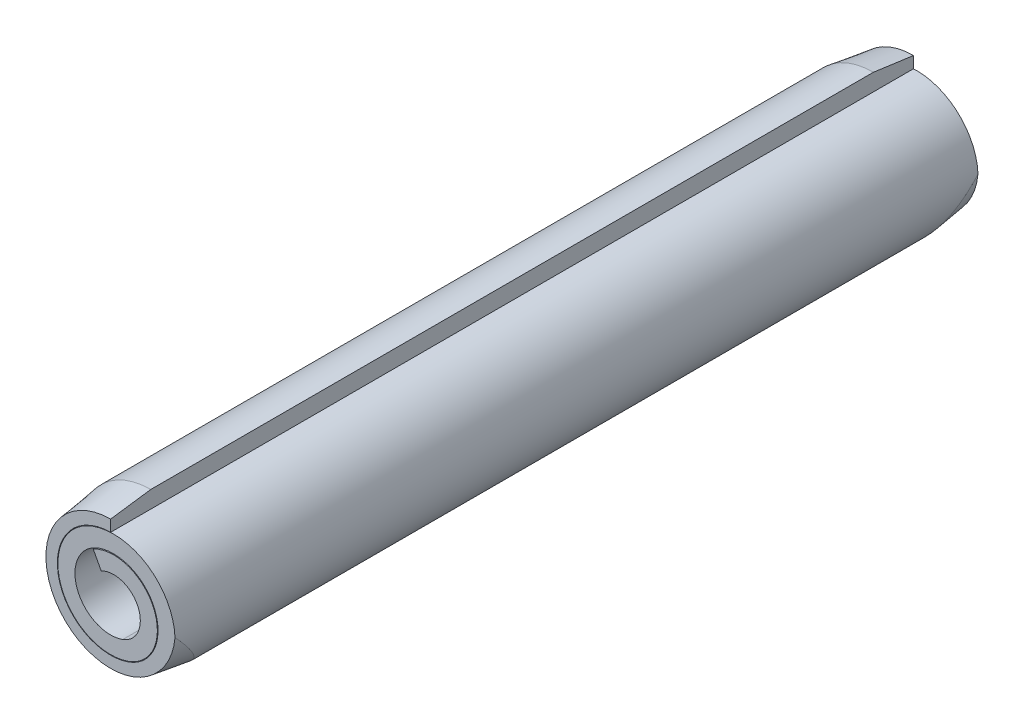
ISO-10303-21;
HEADER;
FILE_DESCRIPTION(('STEP AP214'),'2;1');
FILE_NAME('part.step','',(''),(''),'','','');
FILE_SCHEMA(('AUTOMOTIVE_DESIGN { 1 0 10303 214 1 1 1 1 }'));
ENDSEC;
DATA;
#1=APPLICATION_CONTEXT('core data for automotive mechanical design processes');
#2=APPLICATION_PROTOCOL_DEFINITION('international standard','automotive_design',2000,#1);
#3=PRODUCT_CONTEXT('',#1,'mechanical');
#4=PRODUCT('Part','Part','',(#3));
#5=PRODUCT_RELATED_PRODUCT_CATEGORY('part','',(#4));
#6=PRODUCT_DEFINITION_FORMATION('','',#4);
#7=PRODUCT_DEFINITION_CONTEXT('part definition',#1,'design');
#8=PRODUCT_DEFINITION('design','',#6,#7);
#9=PRODUCT_DEFINITION_SHAPE('','',#8);
#10=(LENGTH_UNIT() NAMED_UNIT(*) SI_UNIT(.MILLI.,.METRE.));
#11=(NAMED_UNIT(*) PLANE_ANGLE_UNIT() SI_UNIT($,.RADIAN.));
#12=(NAMED_UNIT(*) SI_UNIT($,.STERADIAN.) SOLID_ANGLE_UNIT());
#13=UNCERTAINTY_MEASURE_WITH_UNIT(LENGTH_MEASURE(1.E-05),#10,'distance_accuracy_value','');
#14=(GEOMETRIC_REPRESENTATION_CONTEXT(3) GLOBAL_UNCERTAINTY_ASSIGNED_CONTEXT((#13)) GLOBAL_UNIT_ASSIGNED_CONTEXT((#10,
#11,#12)) REPRESENTATION_CONTEXT('',''));
#15=CARTESIAN_POINT('',(0.,0.,0.));
#16=DIRECTION('',(0.,0.,1.));
#17=DIRECTION('',(1.,0.,0.));
#18=AXIS2_PLACEMENT_3D('',#15,#16,#17);
#19=CARTESIAN_POINT('',(-0.211085830625034,0.338291437783564,-9.));
#20=DIRECTION('',(0.883353817881994,0.468706765935062,0.));
#21=DIRECTION('',(-0.468706765935062,0.883353817881994,0.));
#22=AXIS2_PLACEMENT_3D('',#19,#20,#21);
#23=PLANE('',#22);
#24=DIRECTION('',(0.,0.,1.));
#25=VECTOR('',#24,1.);
#26=CARTESIAN_POINT('',(-0.390102521039357,0.675677386600868,-9.));
#27=LINE('',#26,#25);
#28=CARTESIAN_POINT('',(-0.390102521039357,0.675677386600868,-9.));
#29=VERTEX_POINT('',#28);
#30=CARTESIAN_POINT('',(-0.390102521039357,0.675677386600868,9.));
#31=VERTEX_POINT('',#30);
#32=EDGE_CURVE('E240',#29,#31,#27,.T.);
#33=ORIENTED_EDGE('',*,*,#32,.F.);
#34=DIRECTION('',(-0.468706765935062,0.883353817881994,0.));
#35=VECTOR('',#34,1.);
#36=CARTESIAN_POINT('',(-0.211085830625034,0.338291437783564,-9.));
#37=LINE('',#36,#35);
#38=CARTESIAN_POINT('',(-0.211085830625034,0.338291437783564,-9.));
#39=VERTEX_POINT('',#38);
#40=EDGE_CURVE('E125',#39,#29,#37,.T.);
#41=ORIENTED_EDGE('',*,*,#40,.F.);
#42=DIRECTION('',(0.,0.,1.));
#43=VECTOR('',#42,1.);
#44=CARTESIAN_POINT('',(-0.211085830625034,0.338291437783564,-9.));
#45=LINE('',#44,#43);
#46=CARTESIAN_POINT('',(-0.211085830625034,0.338291437783564,9.));
#47=VERTEX_POINT('',#46);
#48=EDGE_CURVE('E109',#47,#39,#45,.F.);
#49=ORIENTED_EDGE('',*,*,#48,.F.);
#50=DIRECTION('',(-0.468706765935062,0.883353817881994,0.));
#51=VECTOR('',#50,1.);
#52=CARTESIAN_POINT('',(-0.211085830625034,0.338291437783564,9.));
#53=LINE('',#52,#51);
#54=EDGE_CURVE('E116',#31,#47,#53,.F.);
#55=ORIENTED_EDGE('',*,*,#54,.F.);
#56=EDGE_LOOP('',(#33,#41,#49,#55));
#57=FACE_BOUND('',#56,.T.);
#58=ADVANCED_FACE('F16',(#57),#23,.F.);
#59=CARTESIAN_POINT('',(0.0689996919525346,-0.189575095588917,-9.));
#60=DIRECTION('',(0.,0.,1.));
#61=DIRECTION('',(1.,0.,0.));
#62=AXIS2_PLACEMENT_3D('',#59,#60,#61);
#63=CYLINDRICAL_SURFACE('',#62,0.597570897059278);
#64=CARTESIAN_POINT('',(0.0689996919525346,-0.189575095588917,-9.));
#65=DIRECTION('',(0.,0.,1.));
#66=DIRECTION('',(1.,0.,0.));
#67=AXIS2_PLACEMENT_3D('',#64,#65,#66);
#68=CIRCLE('',#67,0.597570897059278);
#69=CARTESIAN_POINT('',(0.273380975811996,-0.751108057951937,-9.));
#70=VERTEX_POINT('',#69);
#71=EDGE_CURVE('E101',#70,#39,#68,.T.);
#72=ORIENTED_EDGE('',*,*,#71,.F.);
#73=DIRECTION('',(0.,0.,1.));
#74=VECTOR('',#73,1.);
#75=CARTESIAN_POINT('',(0.273380975811998,-0.751108057951936,-9.));
#76=LINE('',#75,#74);
#77=CARTESIAN_POINT('',(0.273380975811996,-0.751108057951937,9.));
#78=VERTEX_POINT('',#77);
#79=EDGE_CURVE('E112',#70,#78,#76,.T.);
#80=ORIENTED_EDGE('',*,*,#79,.T.);
#81=CARTESIAN_POINT('',(0.0689996919525346,-0.189575095588917,9.));
#82=DIRECTION('',(0.,0.,1.));
#83=DIRECTION('',(1.,0.,0.));
#84=AXIS2_PLACEMENT_3D('',#81,#82,#83);
#85=CIRCLE('',#84,0.597570897059278);
#86=EDGE_CURVE('E19',#47,#78,#85,.F.);
#87=ORIENTED_EDGE('',*,*,#86,.F.);
#88=ORIENTED_EDGE('',*,*,#48,.T.);
#89=EDGE_LOOP('',(#72,#80,#87,#88));
#90=FACE_BOUND('',#89,.T.);
#91=ADVANCED_FACE('F107',(#90),#63,.F.);
#92=CARTESIAN_POINT('',(0.,0.,-9.));
#93=DIRECTION('',(0.,0.,1.));
#94=DIRECTION('',(1.,0.,0.));
#95=AXIS2_PLACEMENT_3D('',#92,#93,#94);
#96=CYLINDRICAL_SURFACE('',#95,1.18125);
#97=CARTESIAN_POINT('',(0.,0.,-9.));
#98=DIRECTION('',(0.,0.,1.));
#99=DIRECTION('',(1.,0.,0.));
#100=AXIS2_PLACEMENT_3D('',#97,#98,#99);
#101=CIRCLE('',#100,1.18125);
#102=CARTESIAN_POINT('',(-0.404011294303447,1.11001190830335,-9.));
#103=VERTEX_POINT('',#102);
#104=CARTESIAN_POINT('',(0.404011294303443,-1.11001190830336,-9.));
#105=VERTEX_POINT('',#104);
#106=EDGE_CURVE('E260',#103,#105,#101,.T.);
#107=ORIENTED_EDGE('',*,*,#106,.T.);
#108=DIRECTION('',(0.,0.,1.));
#109=VECTOR('',#108,1.);
#110=CARTESIAN_POINT('',(0.404011294303446,-1.11001190830335,-9.));
#111=LINE('',#110,#109);
#112=CARTESIAN_POINT('',(0.404011294303443,-1.11001190830336,9.));
#113=VERTEX_POINT('',#112);
#114=EDGE_CURVE('E242',#105,#113,#111,.T.);
#115=ORIENTED_EDGE('',*,*,#114,.T.);
#116=CARTESIAN_POINT('',(0.,0.,9.));
#117=DIRECTION('',(0.,0.,1.));
#118=DIRECTION('',(1.,0.,0.));
#119=AXIS2_PLACEMENT_3D('',#116,#117,#118);
#120=CIRCLE('',#119,1.18125);
#121=CARTESIAN_POINT('',(-0.404011294303447,1.11001190830335,9.));
#122=VERTEX_POINT('',#121);
#123=EDGE_CURVE('E252',#122,#113,#120,.T.);
#124=ORIENTED_EDGE('',*,*,#123,.F.);
#125=DIRECTION('',(0.,0.,1.));
#126=VECTOR('',#125,1.);
#127=CARTESIAN_POINT('',(-0.404011294303447,1.11001190830335,-9.));
#128=LINE('',#127,#126);
#129=EDGE_CURVE('E231',#103,#122,#128,.T.);
#130=ORIENTED_EDGE('',*,*,#129,.F.);
#131=EDGE_LOOP('',(#107,#115,#124,#130));
#132=FACE_BOUND('',#131,.T.);
#133=ADVANCED_FACE('F180',(#132),#96,.T.);
#134=CARTESIAN_POINT('',(0.0689996919525346,-0.189575095588917,-9.));
#135=DIRECTION('',(0.,0.,1.));
#136=DIRECTION('',(1.,0.,0.));
#137=AXIS2_PLACEMENT_3D('',#134,#135,#136);
#138=CYLINDRICAL_SURFACE('',#137,0.979508397059278);
#139=ORIENTED_EDGE('',*,*,#32,.T.);
#140=CARTESIAN_POINT('',(0.0689996919525346,-0.189575095588917,9.));
#141=DIRECTION('',(0.,0.,1.));
#142=DIRECTION('',(1.,0.,0.));
#143=AXIS2_PLACEMENT_3D('',#140,#141,#142);
#144=CIRCLE('',#143,0.979508397059278);
#145=EDGE_CURVE('E121',#113,#31,#144,.T.);
#146=ORIENTED_EDGE('',*,*,#145,.F.);
#147=ORIENTED_EDGE('',*,*,#114,.F.);
#148=CARTESIAN_POINT('',(0.0689996919525346,-0.189575095588917,-9.));
#149=DIRECTION('',(0.,0.,1.));
#150=DIRECTION('',(1.,0.,0.));
#151=AXIS2_PLACEMENT_3D('',#148,#149,#150);
#152=CIRCLE('',#151,0.979508397059278);
#153=EDGE_CURVE('E262',#105,#29,#152,.T.);
#154=ORIENTED_EDGE('',*,*,#153,.T.);
#155=EDGE_LOOP('',(#139,#146,#147,#154));
#156=FACE_BOUND('',#155,.T.);
#157=ADVANCED_FACE('F176',(#156),#138,.T.);
#158=CARTESIAN_POINT('',(0.,0.,-9.));
#159=DIRECTION('',(0.,0.,1.));
#160=DIRECTION('',(1.,0.,0.));
#161=AXIS2_PLACEMENT_3D('',#158,#159,#160);
#162=CYLINDRICAL_SURFACE('',#161,0.799312499999999);
#163=ORIENTED_EDGE('',*,*,#79,.F.);
#164=CARTESIAN_POINT('',(0.,0.,-9.));
#165=DIRECTION('',(0.,0.,1.));
#166=DIRECTION('',(1.,0.,0.));
#167=AXIS2_PLACEMENT_3D('',#164,#165,#166);
#168=CIRCLE('',#167,0.799312499999999);
#169=CARTESIAN_POINT('',(-0.273380975811999,0.751108057951935,-9.));
#170=VERTEX_POINT('',#169);
#171=EDGE_CURVE('E265',#70,#170,#168,.F.);
#172=ORIENTED_EDGE('',*,*,#171,.T.);
#173=DIRECTION('',(0.,0.,1.));
#174=VECTOR('',#173,1.);
#175=CARTESIAN_POINT('',(-0.273380975811999,0.751108057951935,-9.));
#176=LINE('',#175,#174);
#177=CARTESIAN_POINT('',(-0.273380975811999,0.751108057951935,9.));
#178=VERTEX_POINT('',#177);
#179=EDGE_CURVE('E234',#170,#178,#176,.T.);
#180=ORIENTED_EDGE('',*,*,#179,.T.);
#181=CARTESIAN_POINT('',(0.,0.,9.));
#182=DIRECTION('',(0.,0.,1.));
#183=DIRECTION('',(1.,0.,0.));
#184=AXIS2_PLACEMENT_3D('',#181,#182,#183);
#185=CIRCLE('',#184,0.799312499999999);
#186=EDGE_CURVE('E255',#78,#178,#185,.F.);
#187=ORIENTED_EDGE('',*,*,#186,.F.);
#188=EDGE_LOOP('',(#163,#172,#180,#187));
#189=FACE_BOUND('',#188,.T.);
#190=ADVANCED_FACE('F172',(#189),#162,.F.);
#191=CARTESIAN_POINT('',(0.0673352157172413,-0.185001984717226,-9.));
#192=DIRECTION('',(0.,0.,1.));
#193=DIRECTION('',(1.,0.,0.));
#194=AXIS2_PLACEMENT_3D('',#191,#192,#193);
#195=CYLINDRICAL_SURFACE('',#194,0.996187499999999);
#196=CARTESIAN_POINT('',(0.0673352157172413,-0.185001984717226,-9.));
#197=DIRECTION('',(0.,0.,1.));
#198=DIRECTION('',(1.,0.,0.));
#199=AXIS2_PLACEMENT_3D('',#196,#197,#198);
#200=CIRCLE('',#199,0.996187499999999);
#201=CARTESIAN_POINT('',(0.408051407246481,-1.12111202738639,-9.));
#202=VERTEX_POINT('',#201);
#203=EDGE_CURVE('E267',#170,#202,#200,.F.);
#204=ORIENTED_EDGE('',*,*,#203,.T.);
#205=DIRECTION('',(0.,0.,1.));
#206=VECTOR('',#205,1.);
#207=CARTESIAN_POINT('',(0.408051407246481,-1.12111202738639,-9.));
#208=LINE('',#207,#206);
#209=CARTESIAN_POINT('',(0.408051407246481,-1.12111202738639,9.));
#210=VERTEX_POINT('',#209);
#211=EDGE_CURVE('E228',#202,#210,#208,.T.);
#212=ORIENTED_EDGE('',*,*,#211,.T.);
#213=CARTESIAN_POINT('',(0.0673352157172413,-0.185001984717226,9.));
#214=DIRECTION('',(0.,0.,1.));
#215=DIRECTION('',(1.,0.,0.));
#216=AXIS2_PLACEMENT_3D('',#213,#214,#215);
#217=CIRCLE('',#216,0.996187499999999);
#218=EDGE_CURVE('E229',#178,#210,#217,.F.);
#219=ORIENTED_EDGE('',*,*,#218,.F.);
#220=ORIENTED_EDGE('',*,*,#179,.F.);
#221=EDGE_LOOP('',(#204,#212,#219,#220));
#222=FACE_BOUND('',#221,.T.);
#223=ADVANCED_FACE('F169',(#222),#195,.F.);
#224=CARTESIAN_POINT('',(0.0689996919525346,-0.189575095588917,9.));
#225=DIRECTION('',(0.,0.,1.));
#226=DIRECTION('',(1.,0.,0.));
#227=AXIS2_PLACEMENT_3D('',#224,#225,#226);
#228=PLANE('',#227);
#229=CARTESIAN_POINT('',(0.,0.,9.));
#230=DIRECTION('',(0.,0.,1.));
#231=DIRECTION('',(1.,0.,0.));
#232=AXIS2_PLACEMENT_3D('',#229,#230,#231);
#233=CIRCLE('',#232,1.1930625);
#234=CARTESIAN_POINT('',(0.,1.1930625,9.));
#235=VERTEX_POINT('',#234);
#236=EDGE_CURVE('E236',#210,#235,#233,.F.);
#237=ORIENTED_EDGE('',*,*,#236,.T.);
#238=DIRECTION('',(0.,1.,0.));
#239=VECTOR('',#238,1.);
#240=CARTESIAN_POINT('',(0.,-0.189575095588917,9.));
#241=LINE('',#240,#239);
#242=CARTESIAN_POINT('',(0.,1.45000000000275,9.00000000000728));
#243=VERTEX_POINT('',#242);
#244=EDGE_CURVE('E227',#235,#243,#241,.T.);
#245=ORIENTED_EDGE('',*,*,#244,.T.);
#246=CARTESIAN_POINT('',(0.,0.,9.00000000001455));
#247=DIRECTION('',(0.,0.,-1.));
#248=DIRECTION('',(-1.,0.,0.));
#249=AXIS2_PLACEMENT_3D('',#246,#247,#248);
#250=CIRCLE('',#249,1.4500000000055);
#251=CARTESIAN_POINT('',(1.44429938850018,-0.128449509110949,8.9999999999996));
#252=VERTEX_POINT('',#251);
#253=EDGE_CURVE('E134',#252,#243,#250,.T.);
#254=ORIENTED_EDGE('',*,*,#253,.F.);
#255=CARTESIAN_POINT('',(0.0673352157172413,-0.185001984717226,9.));
#256=DIRECTION('',(0.,0.,1.));
#257=DIRECTION('',(1.,0.,0.));
#258=AXIS2_PLACEMENT_3D('',#255,#256,#257);
#259=CIRCLE('',#258,1.378125);
#260=EDGE_CURVE('E233',#252,#122,#259,.T.);
#261=ORIENTED_EDGE('',*,*,#260,.T.);
#262=ORIENTED_EDGE('',*,*,#123,.T.);
#263=ORIENTED_EDGE('',*,*,#145,.T.);
#264=ORIENTED_EDGE('',*,*,#54,.T.);
#265=ORIENTED_EDGE('',*,*,#86,.T.);
#266=ORIENTED_EDGE('',*,*,#186,.T.);
#267=ORIENTED_EDGE('',*,*,#218,.T.);
#268=EDGE_LOOP('',(#237,#245,#254,#261,#262,#263,#264,#265,#266,#267));
#269=FACE_BOUND('',#268,.T.);
#270=ADVANCED_FACE('F119',(#269),#228,.T.);
#271=CARTESIAN_POINT('',(0.,0.,-9.));
#272=DIRECTION('',(0.,0.,1.));
#273=DIRECTION('',(1.,0.,0.));
#274=AXIS2_PLACEMENT_3D('',#271,#272,#273);
#275=CYLINDRICAL_SURFACE('',#274,1.1930625);
#276=ORIENTED_EDGE('',*,*,#211,.F.);
#277=CARTESIAN_POINT('',(0.,0.,-9.));
#278=DIRECTION('',(0.,0.,1.));
#279=DIRECTION('',(1.,0.,0.));
#280=AXIS2_PLACEMENT_3D('',#277,#278,#279);
#281=CIRCLE('',#280,1.1930625);
#282=CARTESIAN_POINT('',(0.,1.1930625,-9.));
#283=VERTEX_POINT('',#282);
#284=EDGE_CURVE('E269',#202,#283,#281,.F.);
#285=ORIENTED_EDGE('',*,*,#284,.T.);
#286=DIRECTION('',(0.,0.,1.));
#287=VECTOR('',#286,1.);
#288=CARTESIAN_POINT('',(0.,1.1930625,-9.));
#289=LINE('',#288,#287);
#290=EDGE_CURVE('E137',#283,#235,#289,.T.);
#291=ORIENTED_EDGE('',*,*,#290,.T.);
#292=ORIENTED_EDGE('',*,*,#236,.F.);
#293=EDGE_LOOP('',(#276,#285,#291,#292));
#294=FACE_BOUND('',#293,.T.);
#295=ADVANCED_FACE('F163',(#294),#275,.F.);
#296=CARTESIAN_POINT('',(0.0689996919525346,-0.189575095588917,-9.));
#297=DIRECTION('',(0.,0.,1.));
#298=DIRECTION('',(1.,0.,0.));
#299=AXIS2_PLACEMENT_3D('',#296,#297,#298);
#300=PLANE('',#299);
#301=CARTESIAN_POINT('',(0.0673352157172413,-0.185001984717226,-9.));
#302=DIRECTION('',(0.,0.,1.));
#303=DIRECTION('',(1.,0.,0.));
#304=AXIS2_PLACEMENT_3D('',#301,#302,#303);
#305=CIRCLE('',#304,1.378125);
#306=CARTESIAN_POINT('',(1.4442993884941,-0.128449509048925,-8.99999999999184));
#307=VERTEX_POINT('',#306);
#308=EDGE_CURVE('E270',#307,#103,#305,.T.);
#309=ORIENTED_EDGE('',*,*,#308,.F.);
#310=CARTESIAN_POINT('',(0.,0.,-9.00000000000728));
#311=DIRECTION('',(0.,0.,1.));
#312=DIRECTION('',(1.,0.,0.));
#313=AXIS2_PLACEMENT_3D('',#310,#311,#312);
#314=CIRCLE('',#313,1.44999999999388);
#315=CARTESIAN_POINT('',(0.,1.44999999999827,-9.0000000000357));
#316=VERTEX_POINT('',#315);
#317=EDGE_CURVE('E130',#316,#307,#314,.T.);
#318=ORIENTED_EDGE('',*,*,#317,.F.);
#319=DIRECTION('',(0.,-1.,0.));
#320=VECTOR('',#319,1.);
#321=CARTESIAN_POINT('',(0.,1.575,-9.));
#322=LINE('',#321,#320);
#323=EDGE_CURVE('E133',#316,#283,#322,.T.);
#324=ORIENTED_EDGE('',*,*,#323,.T.);
#325=ORIENTED_EDGE('',*,*,#284,.F.);
#326=ORIENTED_EDGE('',*,*,#203,.F.);
#327=ORIENTED_EDGE('',*,*,#171,.F.);
#328=ORIENTED_EDGE('',*,*,#71,.T.);
#329=ORIENTED_EDGE('',*,*,#40,.T.);
#330=ORIENTED_EDGE('',*,*,#153,.F.);
#331=ORIENTED_EDGE('',*,*,#106,.F.);
#332=EDGE_LOOP('',(#309,#318,#324,#325,#326,#327,#328,#329,#330,#331));
#333=FACE_BOUND('',#332,.T.);
#334=ADVANCED_FACE('F158',(#333),#300,.F.);
#335=CARTESIAN_POINT('',(0.0673352157172413,-0.185001984717226,-9.));
#336=DIRECTION('',(0.,0.,1.));
#337=DIRECTION('',(1.,0.,0.));
#338=AXIS2_PLACEMENT_3D('',#335,#336,#337);
#339=CYLINDRICAL_SURFACE('',#338,1.378125);
#340=CARTESIAN_POINT('',(0.538681725737929,-1.4800158777378,8.10000000013377));
#341=CARTESIAN_POINT('',(0.568457575291803,-1.46918224784146,8.09999713101628));
#342=CARTESIAN_POINT('',(0.597839499243149,-1.45732031822733,8.10098429130596));
#343=CARTESIAN_POINT('',(0.655594090129832,-1.43166818089949,8.10490183378926));
#344=CARTESIAN_POINT('',(0.683967372478445,-1.41787917521204,8.10783100887027));
#345=CARTESIAN_POINT('',(0.766848538637026,-1.3740290993974,8.11941549407509));
#346=CARTESIAN_POINT('',(0.819605068856571,-1.341305849971,8.13086913587589));
#347=CARTESIAN_POINT('',(0.91886350255145,-1.27029254251756,8.16049297442889));
#348=CARTESIAN_POINT('',(0.96537807650679,-1.23201410026104,8.17864927546407));
#349=CARTESIAN_POINT('',(1.05175685498751,-1.15125624233099,8.22072898540391));
#350=CARTESIAN_POINT('',(1.09160909000056,-1.10876947946312,8.24466258924759));
#351=CARTESIAN_POINT('',(1.17710475141354,-1.00570152050876,8.30644462732102));
#352=CARTESIAN_POINT('',(1.21994637778338,-0.943964007703288,8.34623810526463));
#353=CARTESIAN_POINT('',(1.29370887157189,-0.817925509819063,8.43232155733951));
#354=CARTESIAN_POINT('',(1.32460475054872,-0.753619458310551,8.47862487616102));
#355=CARTESIAN_POINT('',(1.38325770469748,-0.604341069078676,8.59105648021862));
#356=CARTESIAN_POINT('',(1.40709324711908,-0.519124290582799,8.65888893123065));
#357=CARTESIAN_POINT('',(1.43818930890035,-0.350375391470358,8.79985561180811));
#358=CARTESIAN_POINT('',(1.44546431248168,-0.266841862084882,8.8729851506042));
#359=CARTESIAN_POINT('',(1.44545926734968,-0.166056720468179,8.96510866235372));
#360=CARTESIAN_POINT('',(1.4450682430972,-0.147202216422362,8.98251560369966));
#361=CARTESIAN_POINT('',(1.44429938849984,-0.128449509102624,9.00000000003007));
#362=B_SPLINE_CURVE_WITH_KNOTS('',3,(#340,#341,#342,#343,#344,#345,#346,#347,#348,#349,#350,
#351,#352,#353,#354,#355,#356,#357,#358,#359,#360,#361),.UNSPECIFIED.,.F.,.F.,(4,2,2,2,2,2,2,2,
2,2,4),(0.,0.0949867724274584,0.189914558504254,0.378235945696181,0.566169084306071,
0.754436315914468,1.00814215783727,1.26237587384423,1.59518693674558,1.92770680354278,
2.00468244131287),.UNSPECIFIED.);
#363=CARTESIAN_POINT('',(0.538681725737929,-1.48001587773781,8.10000000006688));
#364=VERTEX_POINT('',#363);
#365=EDGE_CURVE('E138',#364,#252,#362,.T.);
#366=ORIENTED_EDGE('',*,*,#365,.F.);
#367=DIRECTION('',(0.,0.,1.));
#368=VECTOR('',#367,1.);
#369=CARTESIAN_POINT('',(0.538681725737929,-1.48001587773781,-9.));
#370=LINE('',#369,#368);
#371=CARTESIAN_POINT('',(0.538681725738364,-1.480015877739,-8.10000000000521));
#372=VERTEX_POINT('',#371);
#373=EDGE_CURVE('E218',#372,#364,#370,.T.);
#374=ORIENTED_EDGE('',*,*,#373,.F.);
#375=CARTESIAN_POINT('',(0.538681725737928,-1.4800158777378,-8.09999999999733));
#376=CARTESIAN_POINT('',(0.568457575291395,-1.46918224784161,-8.09999713087984));
#377=CARTESIAN_POINT('',(0.597839499242344,-1.45732031822765,-8.10098429116955));
#378=CARTESIAN_POINT('',(0.65559409012825,-1.43166818090023,-8.10490183365293));
#379=CARTESIAN_POINT('',(0.683967372476484,-1.41787917521301,-8.10783100873402));
#380=CARTESIAN_POINT('',(0.766848538633941,-1.37402909939916,-8.1194154939391));
#381=CARTESIAN_POINT('',(0.819605068852772,-1.34130584997342,-8.13086913574014));
#382=CARTESIAN_POINT('',(0.918863502546321,-1.27029254252153,-8.16049297429373));
#383=CARTESIAN_POINT('',(0.965378076501044,-1.23201410026591,-8.17864927532924));
#384=CARTESIAN_POINT('',(1.05175685498068,-1.15125624233788,-8.22072898526982));
#385=CARTESIAN_POINT('',(1.09160908999328,-1.10876947947113,-8.24466258911388));
#386=CARTESIAN_POINT('',(1.17710475140619,-1.00570152051867,-8.30644462718879));
#387=CARTESIAN_POINT('',(1.21994637777631,-0.943964007713969,-8.34623810513363));
#388=CARTESIAN_POINT('',(1.29370887156546,-0.817925509831452,-8.43232155721112));
#389=CARTESIAN_POINT('',(1.32460475054265,-0.753619458323876,-8.478624876034));
#390=CARTESIAN_POINT('',(1.38325770469693,-0.604341069082853,-8.59105648010344));
#391=CARTESIAN_POINT('',(1.40709324712121,-0.519124290576773,-8.65888893112708));
#392=CARTESIAN_POINT('',(1.43818930890405,-0.350375391444715,-8.79985561172889));
#393=CARTESIAN_POINT('',(1.44546431248429,-0.266841862049826,-8.87298515053772));
#394=CARTESIAN_POINT('',(1.44545926734907,-0.166056720423758,-8.96510866230187));
#395=CARTESIAN_POINT('',(1.44506824309597,-0.147202216377404,-8.98251560364947));
#396=CARTESIAN_POINT('',(1.44429938849797,-0.128449509057147,-8.99999999998152));
#397=B_SPLINE_CURVE_WITH_KNOTS('',3,(#375,#376,#377,#378,#379,#380,#381,#382,#383,#384,#385,
#386,#387,#388,#389,#390,#391,#392,#393,#394,#395,#396),.UNSPECIFIED.,.F.,.F.,(4,2,2,2,2,2,2,2,
2,2,4),(0.,0.0949867724261567,0.189914558501646,0.378235945690908,0.566169084298099,
0.754436315903808,1.00814215782707,1.26237587383457,1.59518693678158,1.92770680362454,
2.00468244139919),.UNSPECIFIED.);
#398=EDGE_CURVE('E145',#372,#307,#397,.T.);
#399=ORIENTED_EDGE('',*,*,#398,.T.);
#400=ORIENTED_EDGE('',*,*,#308,.T.);
#401=ORIENTED_EDGE('',*,*,#129,.T.);
#402=ORIENTED_EDGE('',*,*,#260,.F.);
#403=EDGE_LOOP('',(#366,#374,#399,#400,#401,#402));
#404=FACE_BOUND('',#403,.T.);
#405=ADVANCED_FACE('F154',(#404),#339,.T.);
#406=CARTESIAN_POINT('',(0.,0.,8.1000000000131));
#407=DIRECTION('',(0.,0.,-1.));
#408=DIRECTION('',(-1.,0.,0.));
#409=AXIS2_PLACEMENT_3D('',#406,#407,#408);
#410=CONICAL_SURFACE('',#409,1.57500000001676,0.138006023669568);
#411=DIRECTION('',(0.,0.137568371274688,-0.990492273177751));
#412=VECTOR('',#411,1.);
#413=CARTESIAN_POINT('',(0.,1.45,9.));
#414=LINE('',#413,#412);
#415=CARTESIAN_POINT('',(0.,1.57500000000838,8.10000000000656));
#416=VERTEX_POINT('',#415);
#417=EDGE_CURVE('E210',#243,#416,#414,.T.);
#418=ORIENTED_EDGE('',*,*,#417,.T.);
#419=CARTESIAN_POINT('',(0.,0.,8.1));
#420=DIRECTION('',(0.,0.,1.));
#421=DIRECTION('',(1.,0.,0.));
#422=AXIS2_PLACEMENT_3D('',#419,#420,#421);
#423=CIRCLE('',#422,1.575);
#424=EDGE_CURVE('E212',#364,#416,#423,.F.);
#425=ORIENTED_EDGE('',*,*,#424,.F.);
#426=ORIENTED_EDGE('',*,*,#365,.T.);
#427=ORIENTED_EDGE('',*,*,#253,.T.);
#428=EDGE_LOOP('',(#418,#425,#426,#427));
#429=FACE_BOUND('',#428,.T.);
#430=ADVANCED_FACE('F151',(#429),#410,.T.);
#431=CARTESIAN_POINT('',(0.,1.575,-9.));
#432=DIRECTION('',(-1.,0.,0.));
#433=DIRECTION('',(0.,-1.,0.));
#434=AXIS2_PLACEMENT_3D('',#431,#432,#433);
#435=PLANE('',#434);
#436=DIRECTION('',(0.,-0.137568371274689,-0.990492273177752));
#437=VECTOR('',#436,1.);
#438=CARTESIAN_POINT('',(8.48781333205985E-12,69308.255555556,499000.));
#439=LINE('',#438,#437);
#440=CARTESIAN_POINT('',(0.,1.57500000000419,-8.10000000000326));
#441=VERTEX_POINT('',#440);
#442=EDGE_CURVE('E34',#441,#316,#439,.T.);
#443=ORIENTED_EDGE('',*,*,#442,.F.);
#444=DIRECTION('',(0.,0.,1.));
#445=VECTOR('',#444,1.);
#446=CARTESIAN_POINT('',(0.,1.575,-9.));
#447=LINE('',#446,#445);
#448=EDGE_CURVE('E25',#416,#441,#447,.F.);
#449=ORIENTED_EDGE('',*,*,#448,.F.);
#450=ORIENTED_EDGE('',*,*,#417,.F.);
#451=ORIENTED_EDGE('',*,*,#244,.F.);
#452=ORIENTED_EDGE('',*,*,#290,.F.);
#453=ORIENTED_EDGE('',*,*,#323,.F.);
#454=EDGE_LOOP('',(#443,#449,#450,#451,#452,#453));
#455=FACE_BOUND('',#454,.T.);
#456=ADVANCED_FACE('F197',(#455),#435,.F.);
#457=CARTESIAN_POINT('',(0.,0.,-8.10000000018363));
#458=DIRECTION('',(0.,0.,1.));
#459=DIRECTION('',(1.,0.,0.));
#460=AXIS2_PLACEMENT_3D('',#457,#458,#459);
#461=CONICAL_SURFACE('',#460,1.57499999997413,0.138006023662683);
#462=CARTESIAN_POINT('',(0.,0.,-8.1));
#463=DIRECTION('',(0.,0.,1.));
#464=DIRECTION('',(1.,0.,0.));
#465=AXIS2_PLACEMENT_3D('',#462,#463,#464);
#466=CIRCLE('',#465,1.575);
#467=EDGE_CURVE('E11',#441,#372,#466,.T.);
#468=ORIENTED_EDGE('',*,*,#467,.F.);
#469=ORIENTED_EDGE('',*,*,#442,.T.);
#470=ORIENTED_EDGE('',*,*,#317,.T.);
#471=ORIENTED_EDGE('',*,*,#398,.F.);
#472=EDGE_LOOP('',(#468,#469,#470,#471));
#473=FACE_BOUND('',#472,.T.);
#474=ADVANCED_FACE('F191',(#473),#461,.T.);
#475=CARTESIAN_POINT('',(0.,0.,-9.));
#476=DIRECTION('',(0.,0.,1.));
#477=DIRECTION('',(1.,0.,0.));
#478=AXIS2_PLACEMENT_3D('',#475,#476,#477);
#479=CYLINDRICAL_SURFACE('',#478,1.575);
#480=ORIENTED_EDGE('',*,*,#448,.T.);
#481=ORIENTED_EDGE('',*,*,#467,.T.);
#482=ORIENTED_EDGE('',*,*,#373,.T.);
#483=ORIENTED_EDGE('',*,*,#424,.T.);
#484=EDGE_LOOP('',(#480,#481,#482,#483));
#485=FACE_BOUND('',#484,.T.);
#486=ADVANCED_FACE('F189',(#485),#479,.T.);
#487=CLOSED_SHELL('',(#58,#91,#133,#157,#190,#223,#270,#295,#334,#405,#430,#456,#474,#486));
#488=MANIFOLD_SOLID_BREP('B1',#487);
#489=ADVANCED_BREP_SHAPE_REPRESENTATION('',(#18,#488),#14);
#490=SHAPE_DEFINITION_REPRESENTATION(#9,#489);
ENDSEC;
END-ISO-10303-21;
